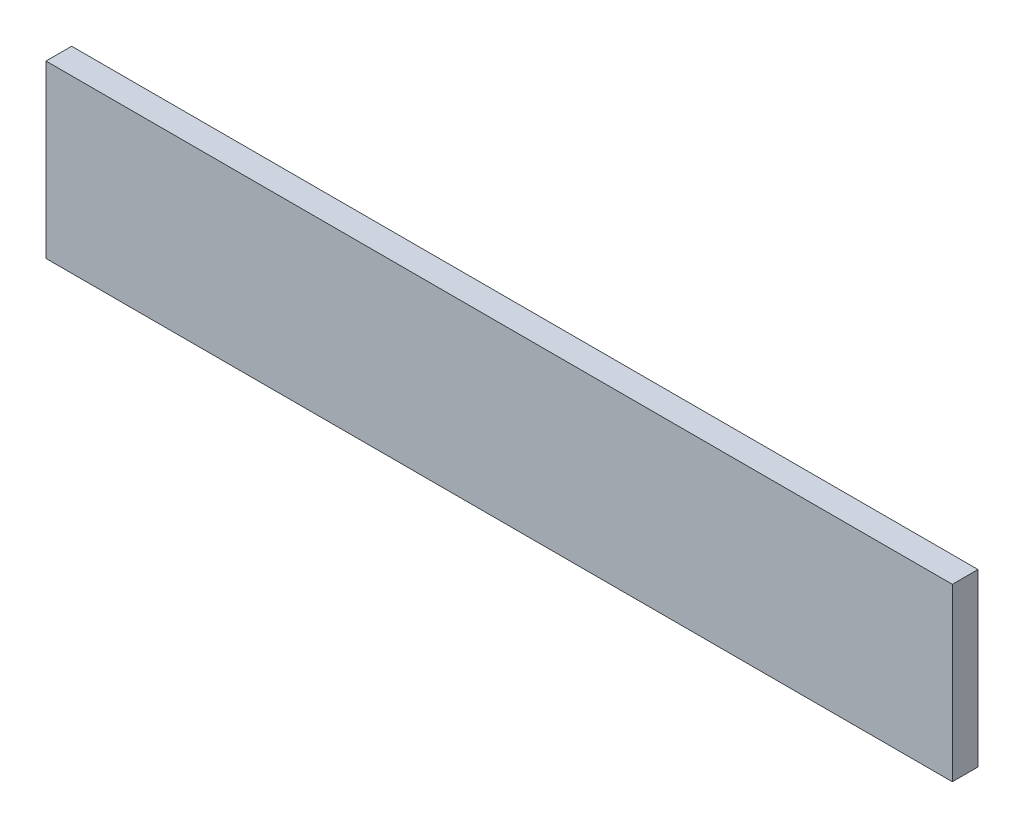
ISO-10303-21;
HEADER;
FILE_DESCRIPTION(('STEP AP214'),'2;1');
FILE_NAME('part.step','',(''),(''),'','','');
FILE_SCHEMA(('AUTOMOTIVE_DESIGN { 1 0 10303 214 1 1 1 1 }'));
ENDSEC;
DATA;
#1=APPLICATION_CONTEXT('core data for automotive mechanical design processes');
#2=APPLICATION_PROTOCOL_DEFINITION('international standard','automotive_design',2000,#1);
#3=PRODUCT_CONTEXT('',#1,'mechanical');
#4=PRODUCT('Part','Part','',(#3));
#5=PRODUCT_RELATED_PRODUCT_CATEGORY('part','',(#4));
#6=PRODUCT_DEFINITION_FORMATION('','',#4);
#7=PRODUCT_DEFINITION_CONTEXT('part definition',#1,'design');
#8=PRODUCT_DEFINITION('design','',#6,#7);
#9=PRODUCT_DEFINITION_SHAPE('','',#8);
#10=(LENGTH_UNIT() NAMED_UNIT(*) SI_UNIT(.MILLI.,.METRE.));
#11=(NAMED_UNIT(*) PLANE_ANGLE_UNIT() SI_UNIT($,.RADIAN.));
#12=(NAMED_UNIT(*) SI_UNIT($,.STERADIAN.) SOLID_ANGLE_UNIT());
#13=UNCERTAINTY_MEASURE_WITH_UNIT(LENGTH_MEASURE(1.E-05),#10,'distance_accuracy_value','');
#14=(GEOMETRIC_REPRESENTATION_CONTEXT(3) GLOBAL_UNCERTAINTY_ASSIGNED_CONTEXT((#13)) GLOBAL_UNIT_ASSIGNED_CONTEXT((#10,
#11,#12)) REPRESENTATION_CONTEXT('',''));
#15=CARTESIAN_POINT('',(0.,0.,0.));
#16=DIRECTION('',(0.,0.,1.));
#17=DIRECTION('',(1.,0.,0.));
#18=AXIS2_PLACEMENT_3D('',#15,#16,#17);
#19=CARTESIAN_POINT('',(0.,0.,-15.));
#20=DIRECTION('',(1.,0.,0.));
#21=DIRECTION('',(0.,1.,0.));
#22=AXIS2_PLACEMENT_3D('',#19,#20,#21);
#23=PLANE('',#22);
#24=DIRECTION('',(0.,1.,0.));
#25=VECTOR('',#24,1.);
#26=CARTESIAN_POINT('',(0.,0.,0.));
#27=LINE('',#26,#25);
#28=CARTESIAN_POINT('',(0.,-100.,0.));
#29=VERTEX_POINT('',#28);
#30=CARTESIAN_POINT('',(0.,0.,0.));
#31=VERTEX_POINT('',#30);
#32=EDGE_CURVE('E102',#29,#31,#27,.T.);
#33=ORIENTED_EDGE('',*,*,#32,.F.);
#34=DIRECTION('',(0.,0.,1.));
#35=VECTOR('',#34,1.);
#36=CARTESIAN_POINT('',(0.,-100.,-15.));
#37=LINE('',#36,#35);
#38=CARTESIAN_POINT('',(0.,-100.,-15.));
#39=VERTEX_POINT('',#38);
#40=EDGE_CURVE('E11',#39,#29,#37,.T.);
#41=ORIENTED_EDGE('',*,*,#40,.F.);
#42=DIRECTION('',(0.,1.,0.));
#43=VECTOR('',#42,1.);
#44=CARTESIAN_POINT('',(0.,0.,-15.));
#45=LINE('',#44,#43);
#46=CARTESIAN_POINT('',(0.,0.,-15.));
#47=VERTEX_POINT('',#46);
#48=EDGE_CURVE('E96',#39,#47,#45,.T.);
#49=ORIENTED_EDGE('',*,*,#48,.T.);
#50=DIRECTION('',(0.,0.,1.));
#51=VECTOR('',#50,1.);
#52=CARTESIAN_POINT('',(0.,0.,-15.));
#53=LINE('',#52,#51);
#54=EDGE_CURVE('E41',#47,#31,#53,.T.);
#55=ORIENTED_EDGE('',*,*,#54,.T.);
#56=EDGE_LOOP('',(#33,#41,#49,#55));
#57=FACE_BOUND('',#56,.T.);
#58=ADVANCED_FACE('F38',(#57),#23,.T.);
#59=CARTESIAN_POINT('',(0.,-100.,-15.));
#60=DIRECTION('',(0.,-1.,0.));
#61=DIRECTION('',(1.,0.,0.));
#62=AXIS2_PLACEMENT_3D('',#59,#60,#61);
#63=PLANE('',#62);
#64=DIRECTION('',(1.,0.,0.));
#65=VECTOR('',#64,1.);
#66=CARTESIAN_POINT('',(0.,-100.,0.));
#67=LINE('',#66,#65);
#68=CARTESIAN_POINT('',(-530.,-100.,0.));
#69=VERTEX_POINT('',#68);
#70=EDGE_CURVE('E98',#69,#29,#67,.T.);
#71=ORIENTED_EDGE('',*,*,#70,.F.);
#72=DIRECTION('',(0.,0.,1.));
#73=VECTOR('',#72,1.);
#74=CARTESIAN_POINT('',(-530.,-100.,-15.));
#75=LINE('',#74,#73);
#76=CARTESIAN_POINT('',(-530.,-100.,-15.));
#77=VERTEX_POINT('',#76);
#78=EDGE_CURVE('E47',#77,#69,#75,.T.);
#79=ORIENTED_EDGE('',*,*,#78,.F.);
#80=DIRECTION('',(1.,0.,0.));
#81=VECTOR('',#80,1.);
#82=CARTESIAN_POINT('',(0.,-100.,-15.));
#83=LINE('',#82,#81);
#84=EDGE_CURVE('E93',#77,#39,#83,.T.);
#85=ORIENTED_EDGE('',*,*,#84,.T.);
#86=ORIENTED_EDGE('',*,*,#40,.T.);
#87=EDGE_LOOP('',(#71,#79,#85,#86));
#88=FACE_BOUND('',#87,.T.);
#89=ADVANCED_FACE('F112',(#88),#63,.T.);
#90=CARTESIAN_POINT('',(-530.,0.,-15.));
#91=DIRECTION('',(-1.,0.,0.));
#92=DIRECTION('',(0.,0.,1.));
#93=AXIS2_PLACEMENT_3D('',#90,#91,#92);
#94=PLANE('',#93);
#95=DIRECTION('',(0.,-1.,0.));
#96=VECTOR('',#95,1.);
#97=CARTESIAN_POINT('',(-530.,0.,0.));
#98=LINE('',#97,#96);
#99=CARTESIAN_POINT('',(-530.,0.,0.));
#100=VERTEX_POINT('',#99);
#101=EDGE_CURVE('E88',#100,#69,#98,.T.);
#102=ORIENTED_EDGE('',*,*,#101,.F.);
#103=DIRECTION('',(0.,0.,1.));
#104=VECTOR('',#103,1.);
#105=CARTESIAN_POINT('',(-530.,0.,-15.));
#106=LINE('',#105,#104);
#107=CARTESIAN_POINT('',(-530.,0.,-15.));
#108=VERTEX_POINT('',#107);
#109=EDGE_CURVE('E83',#108,#100,#106,.T.);
#110=ORIENTED_EDGE('',*,*,#109,.F.);
#111=DIRECTION('',(0.,-1.,0.));
#112=VECTOR('',#111,1.);
#113=CARTESIAN_POINT('',(-530.,0.,-15.));
#114=LINE('',#113,#112);
#115=EDGE_CURVE('E86',#108,#77,#114,.T.);
#116=ORIENTED_EDGE('',*,*,#115,.T.);
#117=ORIENTED_EDGE('',*,*,#78,.T.);
#118=EDGE_LOOP('',(#102,#110,#116,#117));
#119=FACE_BOUND('',#118,.T.);
#120=ADVANCED_FACE('F85',(#119),#94,.T.);
#121=CARTESIAN_POINT('',(0.,0.,-15.));
#122=DIRECTION('',(0.,1.,0.));
#123=DIRECTION('',(0.,0.,1.));
#124=AXIS2_PLACEMENT_3D('',#121,#122,#123);
#125=PLANE('',#124);
#126=DIRECTION('',(-1.,0.,0.));
#127=VECTOR('',#126,1.);
#128=CARTESIAN_POINT('',(0.,0.,0.));
#129=LINE('',#128,#127);
#130=EDGE_CURVE('E105',#31,#100,#129,.T.);
#131=ORIENTED_EDGE('',*,*,#130,.F.);
#132=ORIENTED_EDGE('',*,*,#54,.F.);
#133=DIRECTION('',(-1.,0.,0.));
#134=VECTOR('',#133,1.);
#135=CARTESIAN_POINT('',(0.,0.,-15.));
#136=LINE('',#135,#134);
#137=EDGE_CURVE('E92',#47,#108,#136,.T.);
#138=ORIENTED_EDGE('',*,*,#137,.T.);
#139=ORIENTED_EDGE('',*,*,#109,.T.);
#140=EDGE_LOOP('',(#131,#132,#138,#139));
#141=FACE_BOUND('',#140,.T.);
#142=ADVANCED_FACE('F95',(#141),#125,.T.);
#143=CARTESIAN_POINT('',(0.,0.,-15.));
#144=DIRECTION('',(0.,0.,-1.));
#145=DIRECTION('',(-1.,0.,0.));
#146=AXIS2_PLACEMENT_3D('',#143,#144,#145);
#147=PLANE('',#146);
#148=ORIENTED_EDGE('',*,*,#48,.F.);
#149=ORIENTED_EDGE('',*,*,#84,.F.);
#150=ORIENTED_EDGE('',*,*,#115,.F.);
#151=ORIENTED_EDGE('',*,*,#137,.F.);
#152=EDGE_LOOP('',(#148,#149,#150,#151));
#153=FACE_BOUND('',#152,.T.);
#154=ADVANCED_FACE('F91',(#153),#147,.T.);
#155=CARTESIAN_POINT('',(0.,0.,0.));
#156=DIRECTION('',(0.,0.,-1.));
#157=DIRECTION('',(-1.,0.,0.));
#158=AXIS2_PLACEMENT_3D('',#155,#156,#157);
#159=PLANE('',#158);
#160=ORIENTED_EDGE('',*,*,#32,.T.);
#161=ORIENTED_EDGE('',*,*,#130,.T.);
#162=ORIENTED_EDGE('',*,*,#101,.T.);
#163=ORIENTED_EDGE('',*,*,#70,.T.);
#164=EDGE_LOOP('',(#160,#161,#162,#163));
#165=FACE_BOUND('',#164,.T.);
#166=ADVANCED_FACE('F111',(#165),#159,.F.);
#167=CLOSED_SHELL('',(#58,#89,#120,#142,#154,#166));
#168=MANIFOLD_SOLID_BREP('B2',#167);
#169=ADVANCED_BREP_SHAPE_REPRESENTATION('',(#18,#168),#14);
#170=SHAPE_DEFINITION_REPRESENTATION(#9,#169);
ENDSEC;
END-ISO-10303-21;
